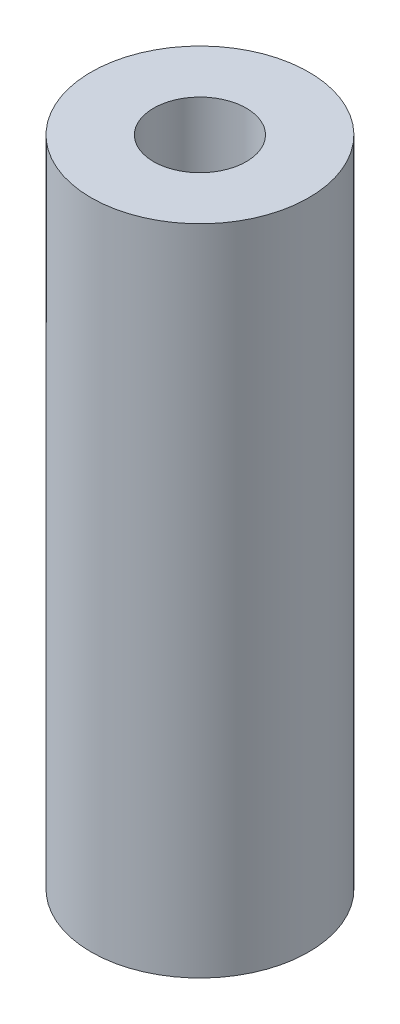
ISO-10303-21;
HEADER;
FILE_DESCRIPTION(('STEP AP214'),'2;1');
FILE_NAME('part.step','',(''),(''),'','','');
FILE_SCHEMA(('AUTOMOTIVE_DESIGN { 1 0 10303 214 1 1 1 1 }'));
ENDSEC;
DATA;
#1=APPLICATION_CONTEXT('core data for automotive mechanical design processes');
#2=APPLICATION_PROTOCOL_DEFINITION('international standard','automotive_design',2000,#1);
#3=PRODUCT_CONTEXT('',#1,'mechanical');
#4=PRODUCT('Part','Part','',(#3));
#5=PRODUCT_RELATED_PRODUCT_CATEGORY('part','',(#4));
#6=PRODUCT_DEFINITION_FORMATION('','',#4);
#7=PRODUCT_DEFINITION_CONTEXT('part definition',#1,'design');
#8=PRODUCT_DEFINITION('design','',#6,#7);
#9=PRODUCT_DEFINITION_SHAPE('','',#8);
#10=(LENGTH_UNIT() NAMED_UNIT(*) SI_UNIT(.MILLI.,.METRE.));
#11=(NAMED_UNIT(*) PLANE_ANGLE_UNIT() SI_UNIT($,.RADIAN.));
#12=(NAMED_UNIT(*) SI_UNIT($,.STERADIAN.) SOLID_ANGLE_UNIT());
#13=UNCERTAINTY_MEASURE_WITH_UNIT(LENGTH_MEASURE(1.E-05),#10,'distance_accuracy_value','');
#14=(GEOMETRIC_REPRESENTATION_CONTEXT(3) GLOBAL_UNCERTAINTY_ASSIGNED_CONTEXT((#13)) GLOBAL_UNIT_ASSIGNED_CONTEXT((#10,
#11,#12)) REPRESENTATION_CONTEXT('',''));
#15=CARTESIAN_POINT('',(0.,0.,0.));
#16=DIRECTION('',(0.,0.,1.));
#17=DIRECTION('',(1.,0.,0.));
#18=AXIS2_PLACEMENT_3D('',#15,#16,#17);
#19=CARTESIAN_POINT('',(0.,19.05,0.));
#20=DIRECTION('',(0.,-1.,0.));
#21=DIRECTION('',(0.,0.,-1.));
#22=AXIS2_PLACEMENT_3D('',#19,#20,#21);
#23=CYLINDRICAL_SURFACE('',#22,3.175);
#24=CARTESIAN_POINT('',(0.,19.05,0.));
#25=DIRECTION('',(0.,1.,0.));
#26=DIRECTION('',(0.,0.,1.));
#27=AXIS2_PLACEMENT_3D('',#24,#25,#26);
#28=CIRCLE('',#27,3.175);
#29=CARTESIAN_POINT('',(0.,19.05,3.175));
#30=VERTEX_POINT('',#29);
#31=EDGE_CURVE('E10',#30,#30,#28,.T.);
#32=ORIENTED_EDGE('',*,*,#31,.F.);
#33=EDGE_LOOP('',(#32));
#34=FACE_BOUND('',#33,.T.);
#35=CARTESIAN_POINT('',(0.,0.,0.));
#36=DIRECTION('',(0.,1.,0.));
#37=DIRECTION('',(0.,0.,1.));
#38=AXIS2_PLACEMENT_3D('',#35,#36,#37);
#39=CIRCLE('',#38,3.175);
#40=CARTESIAN_POINT('',(0.,0.,3.175));
#41=VERTEX_POINT('',#40);
#42=EDGE_CURVE('E34',#41,#41,#39,.T.);
#43=ORIENTED_EDGE('',*,*,#42,.T.);
#44=EDGE_LOOP('',(#43));
#45=FACE_BOUND('',#44,.T.);
#46=ADVANCED_FACE('F31',(#34,#45),#23,.T.);
#47=CARTESIAN_POINT('',(0.,19.05,0.));
#48=DIRECTION('',(0.,1.,0.));
#49=DIRECTION('',(0.,0.,1.));
#50=AXIS2_PLACEMENT_3D('',#47,#48,#49);
#51=PLANE('',#50);
#52=CARTESIAN_POINT('',(0.,19.05,0.));
#53=DIRECTION('',(0.,1.,0.));
#54=DIRECTION('',(0.,0.,1.));
#55=AXIS2_PLACEMENT_3D('',#52,#53,#54);
#56=CIRCLE('',#55,1.35254999999999);
#57=CARTESIAN_POINT('',(0.,19.05,1.35254999999999));
#58=VERTEX_POINT('',#57);
#59=EDGE_CURVE('E45',#58,#58,#56,.T.);
#60=ORIENTED_EDGE('',*,*,#59,.F.);
#61=EDGE_LOOP('',(#60));
#62=FACE_BOUND('',#61,.T.);
#63=ORIENTED_EDGE('',*,*,#31,.T.);
#64=EDGE_LOOP('',(#63));
#65=FACE_BOUND('',#64,.T.);
#66=ADVANCED_FACE('F51',(#62,#65),#51,.T.);
#67=CARTESIAN_POINT('',(0.,0.,0.));
#68=DIRECTION('',(0.,1.,0.));
#69=DIRECTION('',(0.,0.,1.));
#70=AXIS2_PLACEMENT_3D('',#67,#68,#69);
#71=PLANE('',#70);
#72=CARTESIAN_POINT('',(0.,0.,0.));
#73=DIRECTION('',(0.,1.,0.));
#74=DIRECTION('',(0.,0.,1.));
#75=AXIS2_PLACEMENT_3D('',#72,#73,#74);
#76=CIRCLE('',#75,1.35255);
#77=CARTESIAN_POINT('',(0.,0.,1.35255));
#78=VERTEX_POINT('',#77);
#79=EDGE_CURVE('E41',#78,#78,#76,.T.);
#80=ORIENTED_EDGE('',*,*,#79,.T.);
#81=EDGE_LOOP('',(#80));
#82=FACE_BOUND('',#81,.T.);
#83=ORIENTED_EDGE('',*,*,#42,.F.);
#84=EDGE_LOOP('',(#83));
#85=FACE_BOUND('',#84,.T.);
#86=ADVANCED_FACE('F53',(#82,#85),#71,.F.);
#87=CARTESIAN_POINT('',(0.,19.05,0.));
#88=DIRECTION('',(0.,1.,0.));
#89=DIRECTION('',(0.,0.,1.));
#90=AXIS2_PLACEMENT_3D('',#87,#88,#89);
#91=CYLINDRICAL_SURFACE('',#90,1.35254999999999);
#92=ORIENTED_EDGE('',*,*,#79,.F.);
#93=EDGE_LOOP('',(#92));
#94=FACE_BOUND('',#93,.T.);
#95=ORIENTED_EDGE('',*,*,#59,.T.);
#96=EDGE_LOOP('',(#95));
#97=FACE_BOUND('',#96,.T.);
#98=ADVANCED_FACE('F49',(#94,#97),#91,.F.);
#99=CLOSED_SHELL('',(#46,#66,#86,#98));
#100=MANIFOLD_SOLID_BREP('B2',#99);
#101=ADVANCED_BREP_SHAPE_REPRESENTATION('',(#18,#100),#14);
#102=SHAPE_DEFINITION_REPRESENTATION(#9,#101);
ENDSEC;
END-ISO-10303-21;
